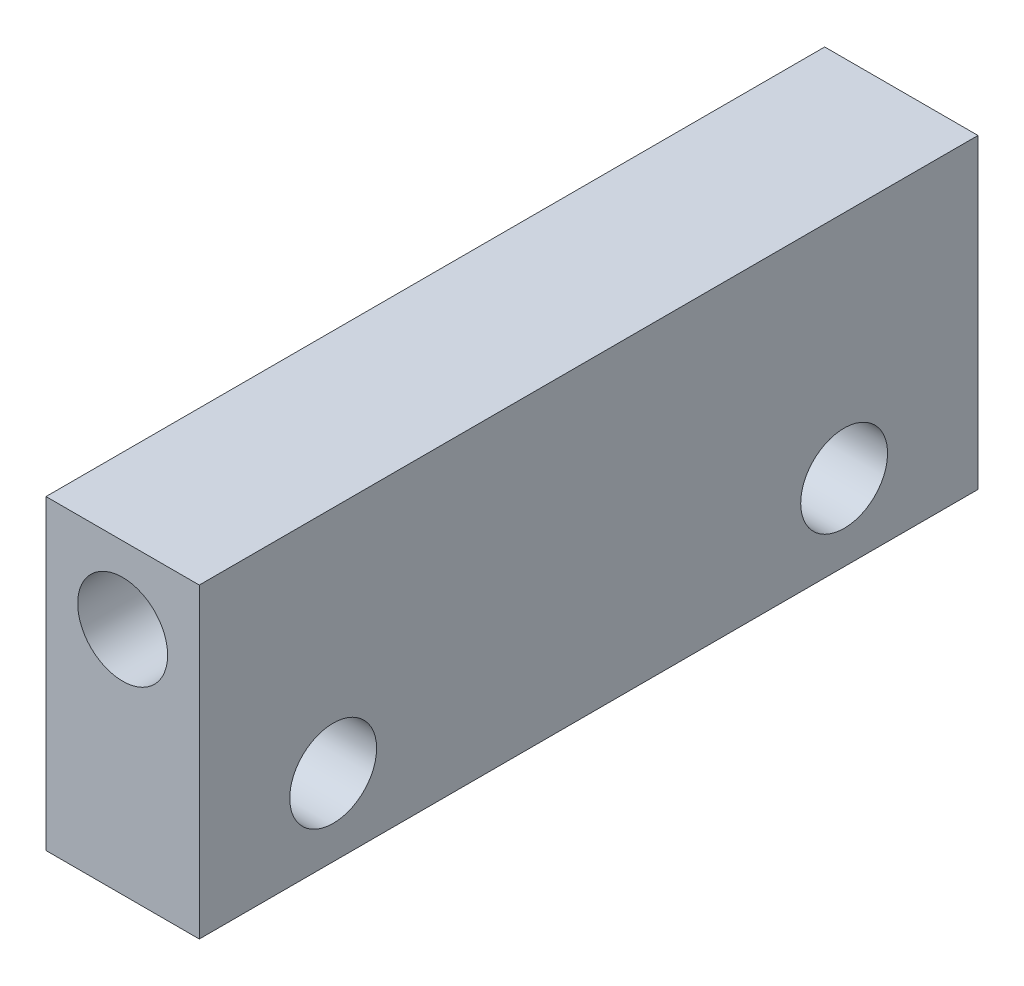
ISO-10303-21;
HEADER;
FILE_DESCRIPTION(('STEP AP214'),'2;1');
FILE_NAME('part.step','',(''),(''),'','','');
FILE_SCHEMA(('AUTOMOTIVE_DESIGN { 1 0 10303 214 1 1 1 1 }'));
ENDSEC;
DATA;
#1=APPLICATION_CONTEXT('core data for automotive mechanical design processes');
#2=APPLICATION_PROTOCOL_DEFINITION('international standard','automotive_design',2000,#1);
#3=PRODUCT_CONTEXT('',#1,'mechanical');
#4=PRODUCT('Part','Part','',(#3));
#5=PRODUCT_RELATED_PRODUCT_CATEGORY('part','',(#4));
#6=PRODUCT_DEFINITION_FORMATION('','',#4);
#7=PRODUCT_DEFINITION_CONTEXT('part definition',#1,'design');
#8=PRODUCT_DEFINITION('design','',#6,#7);
#9=PRODUCT_DEFINITION_SHAPE('','',#8);
#10=(LENGTH_UNIT() NAMED_UNIT(*) SI_UNIT(.MILLI.,.METRE.));
#11=(NAMED_UNIT(*) PLANE_ANGLE_UNIT() SI_UNIT($,.RADIAN.));
#12=(NAMED_UNIT(*) SI_UNIT($,.STERADIAN.) SOLID_ANGLE_UNIT());
#13=UNCERTAINTY_MEASURE_WITH_UNIT(LENGTH_MEASURE(1.E-05),#10,'distance_accuracy_value','');
#14=(GEOMETRIC_REPRESENTATION_CONTEXT(3) GLOBAL_UNCERTAINTY_ASSIGNED_CONTEXT((#13)) GLOBAL_UNIT_ASSIGNED_CONTEXT((#10,
#11,#12)) REPRESENTATION_CONTEXT('',''));
#15=CARTESIAN_POINT('',(0.,0.,0.));
#16=DIRECTION('',(0.,0.,1.));
#17=DIRECTION('',(1.,0.,0.));
#18=AXIS2_PLACEMENT_3D('',#15,#16,#17);
#19=CARTESIAN_POINT('',(0.,0.,76.2));
#20=DIRECTION('',(0.,0.,1.));
#21=DIRECTION('',(1.,0.,0.));
#22=AXIS2_PLACEMENT_3D('',#19,#20,#21);
#23=PLANE('',#22);
#24=DIRECTION('',(0.,-1.,0.));
#25=VECTOR('',#24,1.);
#26=CARTESIAN_POINT('',(-18.4539909866967,39.1927618098416,76.2));
#27=LINE('',#26,#25);
#28=CARTESIAN_POINT('',(-18.4539909866967,39.1927618098416,76.2));
#29=VERTEX_POINT('',#28);
#30=CARTESIAN_POINT('',(-18.4539909866967,9.19276180984159,76.2));
#31=VERTEX_POINT('',#30);
#32=EDGE_CURVE('E92',#29,#31,#27,.T.);
#33=ORIENTED_EDGE('',*,*,#32,.T.);
#34=DIRECTION('',(1.,0.,0.));
#35=VECTOR('',#34,1.);
#36=CARTESIAN_POINT('',(-18.4539909866967,9.19276180984159,76.2));
#37=LINE('',#36,#35);
#38=CARTESIAN_POINT('',(-3.45399098669673,9.19276180984159,76.2));
#39=VERTEX_POINT('',#38);
#40=EDGE_CURVE('E87',#31,#39,#37,.T.);
#41=ORIENTED_EDGE('',*,*,#40,.T.);
#42=DIRECTION('',(0.,1.,0.));
#43=VECTOR('',#42,1.);
#44=CARTESIAN_POINT('',(-3.45399098669674,39.1927618098416,76.2));
#45=LINE('',#44,#43);
#46=CARTESIAN_POINT('',(-3.45399098669674,39.1927618098416,76.2));
#47=VERTEX_POINT('',#46);
#48=EDGE_CURVE('E90',#39,#47,#45,.T.);
#49=ORIENTED_EDGE('',*,*,#48,.T.);
#50=DIRECTION('',(-1.,0.,0.));
#51=VECTOR('',#50,1.);
#52=CARTESIAN_POINT('',(-18.4539909866967,39.1927618098416,76.2));
#53=LINE('',#52,#51);
#54=EDGE_CURVE('E57',#47,#29,#53,.T.);
#55=ORIENTED_EDGE('',*,*,#54,.T.);
#56=EDGE_LOOP('',(#33,#41,#49,#55));
#57=FACE_BOUND('',#56,.T.);
#58=CARTESIAN_POINT('',(-10.9539909866967,31.6927618098416,76.2));
#59=DIRECTION('',(0.,0.,1.));
#60=DIRECTION('',(1.,0.,0.));
#61=AXIS2_PLACEMENT_3D('',#58,#59,#60);
#62=CIRCLE('',#61,4.4);
#63=CARTESIAN_POINT('',(-6.55399098669673,31.6927618098416,76.2));
#64=VERTEX_POINT('',#63);
#65=EDGE_CURVE('E112',#64,#64,#62,.T.);
#66=ORIENTED_EDGE('',*,*,#65,.F.);
#67=EDGE_LOOP('',(#66));
#68=FACE_BOUND('',#67,.T.);
#69=ADVANCED_FACE('F39',(#57,#68),#23,.T.);
#70=CARTESIAN_POINT('',(0.,0.,0.));
#71=DIRECTION('',(0.,0.,1.));
#72=DIRECTION('',(1.,0.,0.));
#73=AXIS2_PLACEMENT_3D('',#70,#71,#72);
#74=PLANE('',#73);
#75=DIRECTION('',(0.,-1.,0.));
#76=VECTOR('',#75,1.);
#77=CARTESIAN_POINT('',(-18.4539909866967,39.1927618098416,0.));
#78=LINE('',#77,#76);
#79=CARTESIAN_POINT('',(-18.4539909866967,39.1927618098416,0.));
#80=VERTEX_POINT('',#79);
#81=CARTESIAN_POINT('',(-18.4539909866967,9.19276180984159,0.));
#82=VERTEX_POINT('',#81);
#83=EDGE_CURVE('E108',#80,#82,#78,.T.);
#84=ORIENTED_EDGE('',*,*,#83,.F.);
#85=DIRECTION('',(-1.,0.,0.));
#86=VECTOR('',#85,1.);
#87=CARTESIAN_POINT('',(-18.4539909866967,39.1927618098416,0.));
#88=LINE('',#87,#86);
#89=CARTESIAN_POINT('',(-3.45399098669674,39.1927618098416,0.));
#90=VERTEX_POINT('',#89);
#91=EDGE_CURVE('E80',#90,#80,#88,.T.);
#92=ORIENTED_EDGE('',*,*,#91,.F.);
#93=DIRECTION('',(0.,1.,0.));
#94=VECTOR('',#93,1.);
#95=CARTESIAN_POINT('',(-3.45399098669674,39.1927618098416,0.));
#96=LINE('',#95,#94);
#97=CARTESIAN_POINT('',(-3.45399098669673,9.19276180984159,0.));
#98=VERTEX_POINT('',#97);
#99=EDGE_CURVE('E74',#98,#90,#96,.T.);
#100=ORIENTED_EDGE('',*,*,#99,.F.);
#101=DIRECTION('',(1.,0.,0.));
#102=VECTOR('',#101,1.);
#103=CARTESIAN_POINT('',(-18.4539909866967,9.19276180984159,0.));
#104=LINE('',#103,#102);
#105=EDGE_CURVE('E97',#82,#98,#104,.T.);
#106=ORIENTED_EDGE('',*,*,#105,.F.);
#107=EDGE_LOOP('',(#84,#92,#100,#106));
#108=FACE_BOUND('',#107,.T.);
#109=CARTESIAN_POINT('',(-10.9539909866967,31.6927618098416,0.));
#110=DIRECTION('',(0.,0.,1.));
#111=DIRECTION('',(1.,0.,0.));
#112=AXIS2_PLACEMENT_3D('',#109,#110,#111);
#113=CIRCLE('',#112,4.4);
#114=CARTESIAN_POINT('',(-6.55399098669673,31.6927618098416,0.));
#115=VERTEX_POINT('',#114);
#116=EDGE_CURVE('E130',#115,#115,#113,.T.);
#117=ORIENTED_EDGE('',*,*,#116,.T.);
#118=EDGE_LOOP('',(#117));
#119=FACE_BOUND('',#118,.T.);
#120=ADVANCED_FACE('F125',(#108,#119),#74,.F.);
#121=CARTESIAN_POINT('',(-18.4539909866967,39.1927618098416,76.2));
#122=DIRECTION('',(1.,0.,0.));
#123=DIRECTION('',(0.,1.,0.));
#124=AXIS2_PLACEMENT_3D('',#121,#122,#123);
#125=PLANE('',#124);
#126=CARTESIAN_POINT('',(-18.4539909866967,16.6927618098416,63.1));
#127=DIRECTION('',(1.,0.,0.));
#128=DIRECTION('',(0.,0.,-1.));
#129=AXIS2_PLACEMENT_3D('',#126,#127,#128);
#130=CIRCLE('',#129,4.25);
#131=CARTESIAN_POINT('',(-18.4539909866967,16.6927618098416,58.85));
#132=VERTEX_POINT('',#131);
#133=EDGE_CURVE('E134',#132,#132,#130,.T.);
#134=ORIENTED_EDGE('',*,*,#133,.T.);
#135=EDGE_LOOP('',(#134));
#136=FACE_BOUND('',#135,.T.);
#137=CARTESIAN_POINT('',(-18.4539909866967,16.6927618098416,13.1));
#138=DIRECTION('',(1.,0.,0.));
#139=DIRECTION('',(0.,0.,1.));
#140=AXIS2_PLACEMENT_3D('',#137,#138,#139);
#141=CIRCLE('',#140,4.25000000000001);
#142=CARTESIAN_POINT('',(-18.4539909866967,16.6927618098416,17.35));
#143=VERTEX_POINT('',#142);
#144=EDGE_CURVE('E142',#143,#143,#141,.T.);
#145=ORIENTED_EDGE('',*,*,#144,.T.);
#146=EDGE_LOOP('',(#145));
#147=FACE_BOUND('',#146,.T.);
#148=ORIENTED_EDGE('',*,*,#83,.T.);
#149=DIRECTION('',(0.,0.,-1.));
#150=VECTOR('',#149,1.);
#151=CARTESIAN_POINT('',(-18.4539909866967,9.19276180984159,76.2));
#152=LINE('',#151,#150);
#153=EDGE_CURVE('E11',#31,#82,#152,.T.);
#154=ORIENTED_EDGE('',*,*,#153,.F.);
#155=ORIENTED_EDGE('',*,*,#32,.F.);
#156=DIRECTION('',(0.,0.,-1.));
#157=VECTOR('',#156,1.);
#158=CARTESIAN_POINT('',(-18.4539909866967,39.1927618098416,76.2));
#159=LINE('',#158,#157);
#160=EDGE_CURVE('E104',#29,#80,#159,.T.);
#161=ORIENTED_EDGE('',*,*,#160,.T.);
#162=EDGE_LOOP('',(#148,#154,#155,#161));
#163=FACE_BOUND('',#162,.T.);
#164=ADVANCED_FACE('F41',(#136,#147,#163),#125,.F.);
#165=CARTESIAN_POINT('',(-18.4539909866967,9.19276180984159,76.2));
#166=DIRECTION('',(0.,1.,0.));
#167=DIRECTION('',(0.,0.,1.));
#168=AXIS2_PLACEMENT_3D('',#165,#166,#167);
#169=PLANE('',#168);
#170=ORIENTED_EDGE('',*,*,#105,.T.);
#171=DIRECTION('',(0.,0.,-1.));
#172=VECTOR('',#171,1.);
#173=CARTESIAN_POINT('',(-3.45399098669673,9.19276180984159,76.2));
#174=LINE('',#173,#172);
#175=EDGE_CURVE('E49',#39,#98,#174,.T.);
#176=ORIENTED_EDGE('',*,*,#175,.F.);
#177=ORIENTED_EDGE('',*,*,#40,.F.);
#178=ORIENTED_EDGE('',*,*,#153,.T.);
#179=EDGE_LOOP('',(#170,#176,#177,#178));
#180=FACE_BOUND('',#179,.T.);
#181=ADVANCED_FACE('F96',(#180),#169,.F.);
#182=CARTESIAN_POINT('',(-3.45399098669674,39.1927618098416,76.2));
#183=DIRECTION('',(-1.,0.,0.));
#184=DIRECTION('',(0.,-1.,0.));
#185=AXIS2_PLACEMENT_3D('',#182,#183,#184);
#186=PLANE('',#185);
#187=CARTESIAN_POINT('',(-3.45399098669673,16.6927618098416,63.1));
#188=DIRECTION('',(1.,0.,0.));
#189=DIRECTION('',(0.,0.,-1.));
#190=AXIS2_PLACEMENT_3D('',#187,#188,#189);
#191=CIRCLE('',#190,4.25);
#192=CARTESIAN_POINT('',(-3.45399098669673,16.6927618098416,58.85));
#193=VERTEX_POINT('',#192);
#194=EDGE_CURVE('E146',#193,#193,#191,.T.);
#195=ORIENTED_EDGE('',*,*,#194,.F.);
#196=EDGE_LOOP('',(#195));
#197=FACE_BOUND('',#196,.T.);
#198=CARTESIAN_POINT('',(-3.45399098669673,16.6927618098416,13.1));
#199=DIRECTION('',(1.,0.,0.));
#200=DIRECTION('',(0.,0.,1.));
#201=AXIS2_PLACEMENT_3D('',#198,#199,#200);
#202=CIRCLE('',#201,4.25000000000001);
#203=CARTESIAN_POINT('',(-3.45399098669673,16.6927618098416,17.35));
#204=VERTEX_POINT('',#203);
#205=EDGE_CURVE('E138',#204,#204,#202,.T.);
#206=ORIENTED_EDGE('',*,*,#205,.F.);
#207=EDGE_LOOP('',(#206));
#208=FACE_BOUND('',#207,.T.);
#209=ORIENTED_EDGE('',*,*,#99,.T.);
#210=DIRECTION('',(0.,0.,-1.));
#211=VECTOR('',#210,1.);
#212=CARTESIAN_POINT('',(-3.45399098669674,39.1927618098416,76.2));
#213=LINE('',#212,#211);
#214=EDGE_CURVE('E99',#47,#90,#213,.T.);
#215=ORIENTED_EDGE('',*,*,#214,.F.);
#216=ORIENTED_EDGE('',*,*,#48,.F.);
#217=ORIENTED_EDGE('',*,*,#175,.T.);
#218=EDGE_LOOP('',(#209,#215,#216,#217));
#219=FACE_BOUND('',#218,.T.);
#220=ADVANCED_FACE('F100',(#197,#208,#219),#186,.F.);
#221=CARTESIAN_POINT('',(-18.4539909866967,39.1927618098416,76.2));
#222=DIRECTION('',(0.,-1.,0.));
#223=DIRECTION('',(0.,0.,-1.));
#224=AXIS2_PLACEMENT_3D('',#221,#222,#223);
#225=PLANE('',#224);
#226=ORIENTED_EDGE('',*,*,#91,.T.);
#227=ORIENTED_EDGE('',*,*,#160,.F.);
#228=ORIENTED_EDGE('',*,*,#54,.F.);
#229=ORIENTED_EDGE('',*,*,#214,.T.);
#230=EDGE_LOOP('',(#226,#227,#228,#229));
#231=FACE_BOUND('',#230,.T.);
#232=ADVANCED_FACE('F122',(#231),#225,.F.);
#233=CARTESIAN_POINT('',(-10.9539909866967,31.6927618098416,76.2));
#234=DIRECTION('',(0.,0.,-1.));
#235=DIRECTION('',(-1.,0.,0.));
#236=AXIS2_PLACEMENT_3D('',#233,#234,#235);
#237=CYLINDRICAL_SURFACE('',#236,4.4);
#238=ORIENTED_EDGE('',*,*,#65,.T.);
#239=EDGE_LOOP('',(#238));
#240=FACE_BOUND('',#239,.T.);
#241=ORIENTED_EDGE('',*,*,#116,.F.);
#242=EDGE_LOOP('',(#241));
#243=FACE_BOUND('',#242,.T.);
#244=ADVANCED_FACE('F169',(#240,#243),#237,.F.);
#245=CARTESIAN_POINT('',(-18.4539909866967,16.6927618098416,13.1));
#246=DIRECTION('',(1.,0.,0.));
#247=DIRECTION('',(0.,0.,-1.));
#248=AXIS2_PLACEMENT_3D('',#245,#246,#247);
#249=CYLINDRICAL_SURFACE('',#248,4.25000000000001);
#250=ORIENTED_EDGE('',*,*,#144,.F.);
#251=EDGE_LOOP('',(#250));
#252=FACE_BOUND('',#251,.T.);
#253=ORIENTED_EDGE('',*,*,#205,.T.);
#254=EDGE_LOOP('',(#253));
#255=FACE_BOUND('',#254,.T.);
#256=ADVANCED_FACE('F159',(#252,#255),#249,.F.);
#257=CARTESIAN_POINT('',(-18.4539909866967,16.6927618098416,63.1));
#258=DIRECTION('',(1.,0.,0.));
#259=DIRECTION('',(0.,0.,-1.));
#260=AXIS2_PLACEMENT_3D('',#257,#258,#259);
#261=CYLINDRICAL_SURFACE('',#260,4.25);
#262=ORIENTED_EDGE('',*,*,#133,.F.);
#263=EDGE_LOOP('',(#262));
#264=FACE_BOUND('',#263,.T.);
#265=ORIENTED_EDGE('',*,*,#194,.T.);
#266=EDGE_LOOP('',(#265));
#267=FACE_BOUND('',#266,.T.);
#268=ADVANCED_FACE('F156',(#264,#267),#261,.F.);
#269=CLOSED_SHELL('',(#69,#120,#164,#181,#220,#232,#244,#256,#268));
#270=MANIFOLD_SOLID_BREP('B2',#269);
#271=ADVANCED_BREP_SHAPE_REPRESENTATION('',(#18,#270),#14);
#272=SHAPE_DEFINITION_REPRESENTATION(#9,#271);
ENDSEC;
END-ISO-10303-21;
